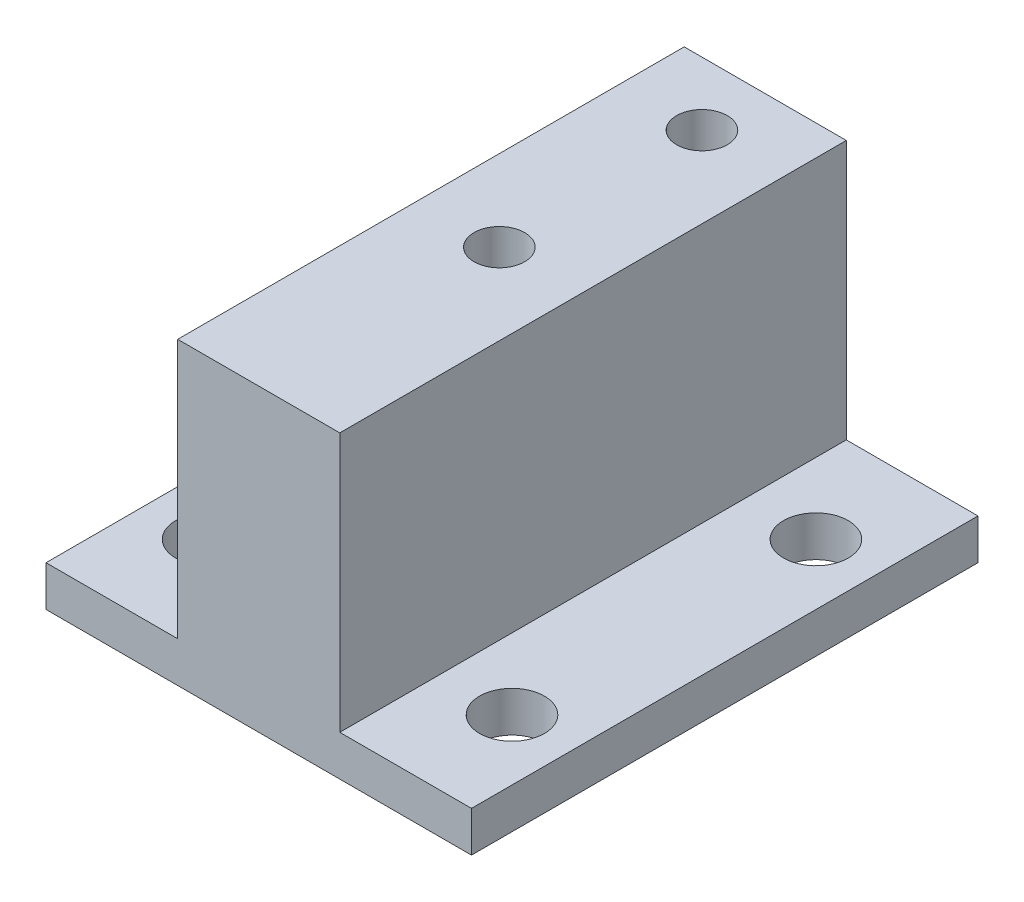
ISO-10303-21;
HEADER;
FILE_DESCRIPTION(('STEP AP214'),'2;1');
FILE_NAME('part.step','',(''),(''),'','','');
FILE_SCHEMA(('AUTOMOTIVE_DESIGN { 1 0 10303 214 1 1 1 1 }'));
ENDSEC;
DATA;
#1=APPLICATION_CONTEXT('core data for automotive mechanical design processes');
#2=APPLICATION_PROTOCOL_DEFINITION('international standard','automotive_design',2000,#1);
#3=PRODUCT_CONTEXT('',#1,'mechanical');
#4=PRODUCT('Part','Part','',(#3));
#5=PRODUCT_RELATED_PRODUCT_CATEGORY('part','',(#4));
#6=PRODUCT_DEFINITION_FORMATION('','',#4);
#7=PRODUCT_DEFINITION_CONTEXT('part definition',#1,'design');
#8=PRODUCT_DEFINITION('design','',#6,#7);
#9=PRODUCT_DEFINITION_SHAPE('','',#8);
#10=(LENGTH_UNIT() NAMED_UNIT(*) SI_UNIT(.MILLI.,.METRE.));
#11=(NAMED_UNIT(*) PLANE_ANGLE_UNIT() SI_UNIT($,.RADIAN.));
#12=(NAMED_UNIT(*) SI_UNIT($,.STERADIAN.) SOLID_ANGLE_UNIT());
#13=UNCERTAINTY_MEASURE_WITH_UNIT(LENGTH_MEASURE(1.E-05),#10,'distance_accuracy_value','');
#14=(GEOMETRIC_REPRESENTATION_CONTEXT(3) GLOBAL_UNCERTAINTY_ASSIGNED_CONTEXT((#13)) GLOBAL_UNIT_ASSIGNED_CONTEXT((#10,
#11,#12)) REPRESENTATION_CONTEXT('',''));
#15=CARTESIAN_POINT('',(0.,0.,0.));
#16=DIRECTION('',(0.,0.,1.));
#17=DIRECTION('',(1.,0.,0.));
#18=AXIS2_PLACEMENT_3D('',#15,#16,#17);
#19=CARTESIAN_POINT('',(20.,14.8,20.));
#20=DIRECTION('',(0.,1.,0.));
#21=DIRECTION('',(0.,0.,1.));
#22=AXIS2_PLACEMENT_3D('',#19,#20,#21);
#23=CYLINDRICAL_SURFACE('',#22,1.6);
#24=CARTESIAN_POINT('',(20.,0.,20.));
#25=DIRECTION('',(0.,1.,0.));
#26=DIRECTION('',(0.,0.,1.));
#27=AXIS2_PLACEMENT_3D('',#24,#25,#26);
#28=CIRCLE('',#27,1.6);
#29=CARTESIAN_POINT('',(20.,0.,21.6));
#30=VERTEX_POINT('',#29);
#31=EDGE_CURVE('E180',#30,#30,#28,.T.);
#32=ORIENTED_EDGE('',*,*,#31,.F.);
#33=EDGE_LOOP('',(#32));
#34=FACE_BOUND('',#33,.T.);
#35=CARTESIAN_POINT('',(20.,2.,20.));
#36=DIRECTION('',(0.,1.,0.));
#37=DIRECTION('',(0.,0.,1.));
#38=AXIS2_PLACEMENT_3D('',#35,#36,#37);
#39=CIRCLE('',#38,1.6);
#40=CARTESIAN_POINT('',(20.,2.,21.6));
#41=VERTEX_POINT('',#40);
#42=EDGE_CURVE('E405',#41,#41,#39,.F.);
#43=ORIENTED_EDGE('',*,*,#42,.F.);
#44=EDGE_LOOP('',(#43));
#45=FACE_BOUND('',#44,.T.);
#46=ADVANCED_FACE('F36',(#34,#45),#23,.F.);
#47=CARTESIAN_POINT('',(20.,14.8,5.));
#48=DIRECTION('',(0.,1.,0.));
#49=DIRECTION('',(0.,0.,1.));
#50=AXIS2_PLACEMENT_3D('',#47,#48,#49);
#51=CYLINDRICAL_SURFACE('',#50,1.6);
#52=CARTESIAN_POINT('',(20.,0.,5.));
#53=DIRECTION('',(0.,1.,0.));
#54=DIRECTION('',(0.,0.,1.));
#55=AXIS2_PLACEMENT_3D('',#52,#53,#54);
#56=CIRCLE('',#55,1.6);
#57=CARTESIAN_POINT('',(20.,0.,6.6));
#58=VERTEX_POINT('',#57);
#59=EDGE_CURVE('E177',#58,#58,#56,.T.);
#60=ORIENTED_EDGE('',*,*,#59,.F.);
#61=EDGE_LOOP('',(#60));
#62=FACE_BOUND('',#61,.T.);
#63=CARTESIAN_POINT('',(20.,2.,5.));
#64=DIRECTION('',(0.,1.,0.));
#65=DIRECTION('',(0.,0.,1.));
#66=AXIS2_PLACEMENT_3D('',#63,#64,#65);
#67=CIRCLE('',#66,1.6);
#68=CARTESIAN_POINT('',(20.,2.,6.6));
#69=VERTEX_POINT('',#68);
#70=EDGE_CURVE('E402',#69,#69,#67,.F.);
#71=ORIENTED_EDGE('',*,*,#70,.F.);
#72=EDGE_LOOP('',(#71));
#73=FACE_BOUND('',#72,.T.);
#74=ADVANCED_FACE('F214',(#62,#73),#51,.F.);
#75=CARTESIAN_POINT('',(23.,-4.74,25.));
#76=DIRECTION('',(-1.,0.,0.));
#77=DIRECTION('',(0.,0.,1.));
#78=AXIS2_PLACEMENT_3D('',#75,#76,#77);
#79=PLANE('',#78);
#80=DIRECTION('',(0.,0.,-1.));
#81=VECTOR('',#80,1.);
#82=CARTESIAN_POINT('',(23.,2.,25.));
#83=LINE('',#82,#81);
#84=CARTESIAN_POINT('',(23.,2.,25.));
#85=VERTEX_POINT('',#84);
#86=CARTESIAN_POINT('',(23.,2.,0.));
#87=VERTEX_POINT('',#86);
#88=EDGE_CURVE('E108',#85,#87,#83,.T.);
#89=ORIENTED_EDGE('',*,*,#88,.F.);
#90=DIRECTION('',(0.,1.,0.));
#91=VECTOR('',#90,1.);
#92=CARTESIAN_POINT('',(23.,-4.74,25.));
#93=LINE('',#92,#91);
#94=CARTESIAN_POINT('',(23.,0.,25.));
#95=VERTEX_POINT('',#94);
#96=EDGE_CURVE('E130',#95,#85,#93,.T.);
#97=ORIENTED_EDGE('',*,*,#96,.F.);
#98=DIRECTION('',(0.,0.,1.));
#99=VECTOR('',#98,1.);
#100=CARTESIAN_POINT('',(23.,0.,0.));
#101=LINE('',#100,#99);
#102=CARTESIAN_POINT('',(23.,0.,0.));
#103=VERTEX_POINT('',#102);
#104=EDGE_CURVE('E129',#103,#95,#101,.T.);
#105=ORIENTED_EDGE('',*,*,#104,.F.);
#106=DIRECTION('',(0.,1.,0.));
#107=VECTOR('',#106,1.);
#108=CARTESIAN_POINT('',(23.,-4.74,0.));
#109=LINE('',#108,#107);
#110=EDGE_CURVE('E120',#103,#87,#109,.T.);
#111=ORIENTED_EDGE('',*,*,#110,.T.);
#112=EDGE_LOOP('',(#89,#97,#105,#111));
#113=FACE_BOUND('',#112,.T.);
#114=ADVANCED_FACE('F127',(#113),#79,.F.);
#115=CARTESIAN_POINT('',(5.,14.8,20.));
#116=DIRECTION('',(0.,1.,0.));
#117=DIRECTION('',(0.,0.,1.));
#118=AXIS2_PLACEMENT_3D('',#115,#116,#117);
#119=CYLINDRICAL_SURFACE('',#118,1.6);
#120=CARTESIAN_POINT('',(5.,0.,20.));
#121=DIRECTION('',(0.,1.,0.));
#122=DIRECTION('',(0.,0.,1.));
#123=AXIS2_PLACEMENT_3D('',#120,#121,#122);
#124=CIRCLE('',#123,1.6);
#125=CARTESIAN_POINT('',(5.,0.,21.6));
#126=VERTEX_POINT('',#125);
#127=EDGE_CURVE('E183',#126,#126,#124,.T.);
#128=ORIENTED_EDGE('',*,*,#127,.F.);
#129=EDGE_LOOP('',(#128));
#130=FACE_BOUND('',#129,.T.);
#131=CARTESIAN_POINT('',(5.,2.,20.));
#132=DIRECTION('',(0.,1.,0.));
#133=DIRECTION('',(0.,0.,1.));
#134=AXIS2_PLACEMENT_3D('',#131,#132,#133);
#135=CIRCLE('',#134,1.6);
#136=CARTESIAN_POINT('',(5.,2.,21.6));
#137=VERTEX_POINT('',#136);
#138=EDGE_CURVE('E131',#137,#137,#135,.F.);
#139=ORIENTED_EDGE('',*,*,#138,.F.);
#140=EDGE_LOOP('',(#139));
#141=FACE_BOUND('',#140,.T.);
#142=ADVANCED_FACE('F226',(#130,#141),#119,.F.);
#143=CARTESIAN_POINT('',(4.99999999999995,14.8,5.));
#144=DIRECTION('',(0.,1.,0.));
#145=DIRECTION('',(0.,0.,1.));
#146=AXIS2_PLACEMENT_3D('',#143,#144,#145);
#147=CYLINDRICAL_SURFACE('',#146,1.6);
#148=CARTESIAN_POINT('',(4.99999999999995,0.,5.));
#149=DIRECTION('',(0.,1.,0.));
#150=DIRECTION('',(0.,0.,1.));
#151=AXIS2_PLACEMENT_3D('',#148,#149,#150);
#152=CIRCLE('',#151,1.6);
#153=CARTESIAN_POINT('',(4.99999999999995,0.,6.6));
#154=VERTEX_POINT('',#153);
#155=EDGE_CURVE('E174',#154,#154,#152,.T.);
#156=ORIENTED_EDGE('',*,*,#155,.F.);
#157=EDGE_LOOP('',(#156));
#158=FACE_BOUND('',#157,.T.);
#159=CARTESIAN_POINT('',(4.99999999999995,2.,5.));
#160=DIRECTION('',(0.,1.,0.));
#161=DIRECTION('',(0.,0.,1.));
#162=AXIS2_PLACEMENT_3D('',#159,#160,#161);
#163=CIRCLE('',#162,1.6);
#164=CARTESIAN_POINT('',(4.99999999999995,2.,6.6));
#165=VERTEX_POINT('',#164);
#166=EDGE_CURVE('E135',#165,#165,#163,.F.);
#167=ORIENTED_EDGE('',*,*,#166,.F.);
#168=EDGE_LOOP('',(#167));
#169=FACE_BOUND('',#168,.T.);
#170=ADVANCED_FACE('F228',(#158,#169),#147,.F.);
#171=CARTESIAN_POINT('',(2.,-4.74,25.));
#172=DIRECTION('',(1.,0.,0.));
#173=DIRECTION('',(0.,0.,-1.));
#174=AXIS2_PLACEMENT_3D('',#171,#172,#173);
#175=PLANE('',#174);
#176=DIRECTION('',(0.,0.,1.));
#177=VECTOR('',#176,1.);
#178=CARTESIAN_POINT('',(2.,2.,25.));
#179=LINE('',#178,#177);
#180=CARTESIAN_POINT('',(2.,2.,0.));
#181=VERTEX_POINT('',#180);
#182=CARTESIAN_POINT('',(2.,2.,25.));
#183=VERTEX_POINT('',#182);
#184=EDGE_CURVE('E196',#181,#183,#179,.T.);
#185=ORIENTED_EDGE('',*,*,#184,.F.);
#186=DIRECTION('',(0.,1.,0.));
#187=VECTOR('',#186,1.);
#188=CARTESIAN_POINT('',(2.,-4.74,0.));
#189=LINE('',#188,#187);
#190=CARTESIAN_POINT('',(2.,0.,0.));
#191=VERTEX_POINT('',#190);
#192=EDGE_CURVE('E140',#191,#181,#189,.T.);
#193=ORIENTED_EDGE('',*,*,#192,.F.);
#194=DIRECTION('',(0.,0.,-1.));
#195=VECTOR('',#194,1.);
#196=CARTESIAN_POINT('',(2.,0.,0.));
#197=LINE('',#196,#195);
#198=CARTESIAN_POINT('',(2.,0.,25.));
#199=VERTEX_POINT('',#198);
#200=EDGE_CURVE('E143',#199,#191,#197,.T.);
#201=ORIENTED_EDGE('',*,*,#200,.F.);
#202=DIRECTION('',(0.,1.,0.));
#203=VECTOR('',#202,1.);
#204=CARTESIAN_POINT('',(2.,-4.74,25.));
#205=LINE('',#204,#203);
#206=EDGE_CURVE('E139',#199,#183,#205,.T.);
#207=ORIENTED_EDGE('',*,*,#206,.T.);
#208=EDGE_LOOP('',(#185,#193,#201,#207));
#209=FACE_BOUND('',#208,.T.);
#210=ADVANCED_FACE('F195',(#209),#175,.F.);
#211=CARTESIAN_POINT('',(0.,14.8,25.));
#212=DIRECTION('',(0.,0.,-1.));
#213=DIRECTION('',(-1.,0.,0.));
#214=AXIS2_PLACEMENT_3D('',#211,#212,#213);
#215=PLANE('',#214);
#216=DIRECTION('',(1.,0.,0.));
#217=VECTOR('',#216,1.);
#218=CARTESIAN_POINT('',(23.,2.,25.));
#219=LINE('',#218,#217);
#220=CARTESIAN_POINT('',(16.5,2.,25.));
#221=VERTEX_POINT('',#220);
#222=EDGE_CURVE('E53',#221,#85,#219,.T.);
#223=ORIENTED_EDGE('',*,*,#222,.F.);
#224=DIRECTION('',(0.,1.,0.));
#225=VECTOR('',#224,1.);
#226=CARTESIAN_POINT('',(16.5,5.03,25.));
#227=LINE('',#226,#225);
#228=CARTESIAN_POINT('',(16.5,14.8,25.));
#229=VERTEX_POINT('',#228);
#230=EDGE_CURVE('E150',#221,#229,#227,.T.);
#231=ORIENTED_EDGE('',*,*,#230,.T.);
#232=DIRECTION('',(1.,0.,0.));
#233=VECTOR('',#232,1.);
#234=CARTESIAN_POINT('',(0.,14.8,25.));
#235=LINE('',#234,#233);
#236=CARTESIAN_POINT('',(8.5,14.8,25.));
#237=VERTEX_POINT('',#236);
#238=EDGE_CURVE('E45',#237,#229,#235,.T.);
#239=ORIENTED_EDGE('',*,*,#238,.F.);
#240=DIRECTION('',(0.,1.,0.));
#241=VECTOR('',#240,1.);
#242=CARTESIAN_POINT('',(8.5,5.03,25.));
#243=LINE('',#242,#241);
#244=CARTESIAN_POINT('',(8.5,2.,25.));
#245=VERTEX_POINT('',#244);
#246=EDGE_CURVE('E157',#245,#237,#243,.T.);
#247=ORIENTED_EDGE('',*,*,#246,.F.);
#248=DIRECTION('',(1.,0.,0.));
#249=VECTOR('',#248,1.);
#250=CARTESIAN_POINT('',(8.5,2.,25.));
#251=LINE('',#250,#249);
#252=EDGE_CURVE('E415',#183,#245,#251,.T.);
#253=ORIENTED_EDGE('',*,*,#252,.F.);
#254=ORIENTED_EDGE('',*,*,#206,.F.);
#255=DIRECTION('',(1.,0.,0.));
#256=VECTOR('',#255,1.);
#257=CARTESIAN_POINT('',(0.,0.,25.));
#258=LINE('',#257,#256);
#259=EDGE_CURVE('E186',#199,#95,#258,.T.);
#260=ORIENTED_EDGE('',*,*,#259,.T.);
#261=ORIENTED_EDGE('',*,*,#96,.T.);
#262=EDGE_LOOP('',(#223,#231,#239,#247,#253,#254,#260,#261));
#263=FACE_BOUND('',#262,.T.);
#264=ADVANCED_FACE('F38',(#263),#215,.F.);
#265=CARTESIAN_POINT('',(0.,14.8,0.));
#266=DIRECTION('',(0.,0.,1.));
#267=DIRECTION('',(1.,0.,0.));
#268=AXIS2_PLACEMENT_3D('',#265,#266,#267);
#269=PLANE('',#268);
#270=DIRECTION('',(0.,1.,0.));
#271=VECTOR('',#270,1.);
#272=CARTESIAN_POINT('',(16.5,5.03,0.));
#273=LINE('',#272,#271);
#274=CARTESIAN_POINT('',(16.5,2.,0.));
#275=VERTEX_POINT('',#274);
#276=CARTESIAN_POINT('',(16.5,14.8,0.));
#277=VERTEX_POINT('',#276);
#278=EDGE_CURVE('E123',#275,#277,#273,.T.);
#279=ORIENTED_EDGE('',*,*,#278,.F.);
#280=DIRECTION('',(-1.,0.,0.));
#281=VECTOR('',#280,1.);
#282=CARTESIAN_POINT('',(23.,2.,0.));
#283=LINE('',#282,#281);
#284=EDGE_CURVE('E112',#87,#275,#283,.T.);
#285=ORIENTED_EDGE('',*,*,#284,.F.);
#286=ORIENTED_EDGE('',*,*,#110,.F.);
#287=DIRECTION('',(-1.,0.,0.));
#288=VECTOR('',#287,1.);
#289=CARTESIAN_POINT('',(0.,0.,0.));
#290=LINE('',#289,#288);
#291=EDGE_CURVE('E40',#103,#191,#290,.T.);
#292=ORIENTED_EDGE('',*,*,#291,.T.);
#293=ORIENTED_EDGE('',*,*,#192,.T.);
#294=DIRECTION('',(-1.,0.,0.));
#295=VECTOR('',#294,1.);
#296=CARTESIAN_POINT('',(8.5,2.,0.));
#297=LINE('',#296,#295);
#298=CARTESIAN_POINT('',(8.5,2.,0.));
#299=VERTEX_POINT('',#298);
#300=EDGE_CURVE('E61',#299,#181,#297,.T.);
#301=ORIENTED_EDGE('',*,*,#300,.F.);
#302=DIRECTION('',(0.,1.,0.));
#303=VECTOR('',#302,1.);
#304=CARTESIAN_POINT('',(8.5,5.03,0.));
#305=LINE('',#304,#303);
#306=CARTESIAN_POINT('',(8.5,14.8,0.));
#307=VERTEX_POINT('',#306);
#308=EDGE_CURVE('E158',#299,#307,#305,.T.);
#309=ORIENTED_EDGE('',*,*,#308,.T.);
#310=DIRECTION('',(-1.,0.,0.));
#311=VECTOR('',#310,1.);
#312=CARTESIAN_POINT('',(0.,14.8,0.));
#313=LINE('',#312,#311);
#314=EDGE_CURVE('E11',#277,#307,#313,.T.);
#315=ORIENTED_EDGE('',*,*,#314,.F.);
#316=EDGE_LOOP('',(#279,#285,#286,#292,#293,#301,#309,#315));
#317=FACE_BOUND('',#316,.T.);
#318=ADVANCED_FACE('F119',(#317),#269,.F.);
#319=CARTESIAN_POINT('',(0.,14.8,0.));
#320=DIRECTION('',(0.,1.,0.));
#321=DIRECTION('',(0.,0.,1.));
#322=AXIS2_PLACEMENT_3D('',#319,#320,#321);
#323=PLANE('',#322);
#324=DIRECTION('',(0.,0.,1.));
#325=VECTOR('',#324,1.);
#326=CARTESIAN_POINT('',(16.5,14.8,25.));
#327=LINE('',#326,#325);
#328=EDGE_CURVE('E148',#277,#229,#327,.T.);
#329=ORIENTED_EDGE('',*,*,#328,.F.);
#330=ORIENTED_EDGE('',*,*,#314,.T.);
#331=DIRECTION('',(0.,0.,-1.));
#332=VECTOR('',#331,1.);
#333=CARTESIAN_POINT('',(8.5,14.8,25.));
#334=LINE('',#333,#332);
#335=EDGE_CURVE('E153',#237,#307,#334,.T.);
#336=ORIENTED_EDGE('',*,*,#335,.F.);
#337=ORIENTED_EDGE('',*,*,#238,.T.);
#338=EDGE_LOOP('',(#329,#330,#336,#337));
#339=FACE_BOUND('',#338,.T.);
#340=CARTESIAN_POINT('',(12.5,14.8,3.12423319118437));
#341=DIRECTION('',(0.,1.,0.));
#342=DIRECTION('',(0.,0.,1.));
#343=AXIS2_PLACEMENT_3D('',#340,#341,#342);
#344=CIRCLE('',#343,1.25);
#345=CARTESIAN_POINT('',(12.5,14.8,4.37423319118436));
#346=VERTEX_POINT('',#345);
#347=EDGE_CURVE('E161',#346,#346,#344,.T.);
#348=ORIENTED_EDGE('',*,*,#347,.F.);
#349=EDGE_LOOP('',(#348));
#350=FACE_BOUND('',#349,.T.);
#351=CARTESIAN_POINT('',(12.5000000000001,14.8,13.1242331911844));
#352=DIRECTION('',(0.,1.,0.));
#353=DIRECTION('',(0.,0.,1.));
#354=AXIS2_PLACEMENT_3D('',#351,#352,#353);
#355=CIRCLE('',#354,1.25);
#356=CARTESIAN_POINT('',(12.5000000000001,14.8,14.3742331911844));
#357=VERTEX_POINT('',#356);
#358=EDGE_CURVE('E168',#357,#357,#355,.T.);
#359=ORIENTED_EDGE('',*,*,#358,.F.);
#360=EDGE_LOOP('',(#359));
#361=FACE_BOUND('',#360,.T.);
#362=ADVANCED_FACE('F200',(#339,#350,#361),#323,.T.);
#363=CARTESIAN_POINT('',(0.,0.,0.));
#364=DIRECTION('',(0.,1.,0.));
#365=DIRECTION('',(0.,0.,1.));
#366=AXIS2_PLACEMENT_3D('',#363,#364,#365);
#367=PLANE('',#366);
#368=ORIENTED_EDGE('',*,*,#155,.T.);
#369=EDGE_LOOP('',(#368));
#370=FACE_BOUND('',#369,.T.);
#371=ORIENTED_EDGE('',*,*,#59,.T.);
#372=EDGE_LOOP('',(#371));
#373=FACE_BOUND('',#372,.T.);
#374=ORIENTED_EDGE('',*,*,#31,.T.);
#375=EDGE_LOOP('',(#374));
#376=FACE_BOUND('',#375,.T.);
#377=ORIENTED_EDGE('',*,*,#127,.T.);
#378=EDGE_LOOP('',(#377));
#379=FACE_BOUND('',#378,.T.);
#380=ORIENTED_EDGE('',*,*,#291,.F.);
#381=ORIENTED_EDGE('',*,*,#104,.T.);
#382=ORIENTED_EDGE('',*,*,#259,.F.);
#383=ORIENTED_EDGE('',*,*,#200,.T.);
#384=EDGE_LOOP('',(#380,#381,#382,#383));
#385=FACE_BOUND('',#384,.T.);
#386=ADVANCED_FACE('F197',(#370,#373,#376,#379,#385),#367,.F.);
#387=CARTESIAN_POINT('',(12.5000000000001,7.3,13.1242331911844));
#388=DIRECTION('',(0.,1.,0.));
#389=DIRECTION('',(0.,0.,1.));
#390=AXIS2_PLACEMENT_3D('',#387,#388,#389);
#391=CONICAL_SURFACE('',#390,1.25,1.02974425867665);
#392=CARTESIAN_POINT('',(12.5000000000001,6.54892422621555,13.1242331911844));
#393=VERTEX_POINT('',#392);
#394=VERTEX_LOOP('',#393);
#395=FACE_BOUND('',#394,.T.);
#396=CARTESIAN_POINT('',(12.5000000000001,7.3,13.1242331911844));
#397=DIRECTION('',(0.,1.,0.));
#398=DIRECTION('',(0.,0.,1.));
#399=AXIS2_PLACEMENT_3D('',#396,#397,#398);
#400=CIRCLE('',#399,1.25);
#401=CARTESIAN_POINT('',(12.5000000000001,7.3,14.3742331911844));
#402=VERTEX_POINT('',#401);
#403=EDGE_CURVE('E171',#402,#402,#400,.T.);
#404=ORIENTED_EDGE('',*,*,#403,.T.);
#405=EDGE_LOOP('',(#404));
#406=FACE_BOUND('',#405,.T.);
#407=ADVANCED_FACE('F199',(#395,#406),#391,.F.);
#408=CARTESIAN_POINT('',(12.5000000000001,14.8,13.1242331911844));
#409=DIRECTION('',(0.,1.,0.));
#410=DIRECTION('',(0.,0.,1.));
#411=AXIS2_PLACEMENT_3D('',#408,#409,#410);
#412=CYLINDRICAL_SURFACE('',#411,1.25);
#413=ORIENTED_EDGE('',*,*,#403,.F.);
#414=EDGE_LOOP('',(#413));
#415=FACE_BOUND('',#414,.T.);
#416=ORIENTED_EDGE('',*,*,#358,.T.);
#417=EDGE_LOOP('',(#416));
#418=FACE_BOUND('',#417,.T.);
#419=ADVANCED_FACE('F207',(#415,#418),#412,.F.);
#420=CARTESIAN_POINT('',(12.5,7.3,3.12423319118437));
#421=DIRECTION('',(0.,1.,0.));
#422=DIRECTION('',(0.,0.,1.));
#423=AXIS2_PLACEMENT_3D('',#420,#421,#422);
#424=CONICAL_SURFACE('',#423,1.25,1.02974425867665);
#425=CARTESIAN_POINT('',(12.5,6.54892422621555,3.12423319118437));
#426=VERTEX_POINT('',#425);
#427=VERTEX_LOOP('',#426);
#428=FACE_BOUND('',#427,.T.);
#429=CARTESIAN_POINT('',(12.5,7.3,3.12423319118437));
#430=DIRECTION('',(0.,1.,0.));
#431=DIRECTION('',(0.,0.,1.));
#432=AXIS2_PLACEMENT_3D('',#429,#430,#431);
#433=CIRCLE('',#432,1.25);
#434=CARTESIAN_POINT('',(12.5,7.3,4.37423319118436));
#435=VERTEX_POINT('',#434);
#436=EDGE_CURVE('E165',#435,#435,#433,.T.);
#437=ORIENTED_EDGE('',*,*,#436,.T.);
#438=EDGE_LOOP('',(#437));
#439=FACE_BOUND('',#438,.T.);
#440=ADVANCED_FACE('F262',(#428,#439),#424,.F.);
#441=CARTESIAN_POINT('',(12.5,14.8,3.12423319118437));
#442=DIRECTION('',(0.,1.,0.));
#443=DIRECTION('',(0.,0.,1.));
#444=AXIS2_PLACEMENT_3D('',#441,#442,#443);
#445=CYLINDRICAL_SURFACE('',#444,1.25);
#446=ORIENTED_EDGE('',*,*,#436,.F.);
#447=EDGE_LOOP('',(#446));
#448=FACE_BOUND('',#447,.T.);
#449=ORIENTED_EDGE('',*,*,#347,.T.);
#450=EDGE_LOOP('',(#449));
#451=FACE_BOUND('',#450,.T.);
#452=ADVANCED_FACE('F258',(#448,#451),#445,.F.);
#453=CARTESIAN_POINT('',(8.5,5.03,25.));
#454=DIRECTION('',(1.,0.,0.));
#455=DIRECTION('',(0.,0.,-1.));
#456=AXIS2_PLACEMENT_3D('',#453,#454,#455);
#457=PLANE('',#456);
#458=ORIENTED_EDGE('',*,*,#335,.T.);
#459=ORIENTED_EDGE('',*,*,#308,.F.);
#460=DIRECTION('',(0.,0.,-1.));
#461=VECTOR('',#460,1.);
#462=CARTESIAN_POINT('',(8.5,2.,25.));
#463=LINE('',#462,#461);
#464=EDGE_CURVE('E411',#245,#299,#463,.T.);
#465=ORIENTED_EDGE('',*,*,#464,.F.);
#466=ORIENTED_EDGE('',*,*,#246,.T.);
#467=EDGE_LOOP('',(#458,#459,#465,#466));
#468=FACE_BOUND('',#467,.T.);
#469=ADVANCED_FACE('F249',(#468),#457,.F.);
#470=CARTESIAN_POINT('',(16.5,5.03,25.));
#471=DIRECTION('',(-1.,0.,0.));
#472=DIRECTION('',(0.,0.,1.));
#473=AXIS2_PLACEMENT_3D('',#470,#471,#472);
#474=PLANE('',#473);
#475=ORIENTED_EDGE('',*,*,#328,.T.);
#476=ORIENTED_EDGE('',*,*,#230,.F.);
#477=DIRECTION('',(0.,0.,1.));
#478=VECTOR('',#477,1.);
#479=CARTESIAN_POINT('',(16.5,2.,25.));
#480=LINE('',#479,#478);
#481=EDGE_CURVE('E125',#275,#221,#480,.T.);
#482=ORIENTED_EDGE('',*,*,#481,.F.);
#483=ORIENTED_EDGE('',*,*,#278,.T.);
#484=EDGE_LOOP('',(#475,#476,#482,#483));
#485=FACE_BOUND('',#484,.T.);
#486=ADVANCED_FACE('F242',(#485),#474,.F.);
#487=CARTESIAN_POINT('',(0.,2.,0.));
#488=DIRECTION('',(0.,1.,0.));
#489=DIRECTION('',(0.,0.,1.));
#490=AXIS2_PLACEMENT_3D('',#487,#488,#489);
#491=PLANE('',#490);
#492=ORIENTED_EDGE('',*,*,#464,.T.);
#493=ORIENTED_EDGE('',*,*,#300,.T.);
#494=ORIENTED_EDGE('',*,*,#184,.T.);
#495=ORIENTED_EDGE('',*,*,#252,.T.);
#496=EDGE_LOOP('',(#492,#493,#494,#495));
#497=FACE_BOUND('',#496,.T.);
#498=ORIENTED_EDGE('',*,*,#166,.T.);
#499=EDGE_LOOP('',(#498));
#500=FACE_BOUND('',#499,.T.);
#501=ORIENTED_EDGE('',*,*,#138,.T.);
#502=EDGE_LOOP('',(#501));
#503=FACE_BOUND('',#502,.T.);
#504=ADVANCED_FACE('F240',(#497,#500,#503),#491,.T.);
#505=CARTESIAN_POINT('',(0.,2.,0.));
#506=DIRECTION('',(0.,1.,0.));
#507=DIRECTION('',(0.,0.,1.));
#508=AXIS2_PLACEMENT_3D('',#505,#506,#507);
#509=PLANE('',#508);
#510=ORIENTED_EDGE('',*,*,#88,.T.);
#511=ORIENTED_EDGE('',*,*,#284,.T.);
#512=ORIENTED_EDGE('',*,*,#481,.T.);
#513=ORIENTED_EDGE('',*,*,#222,.T.);
#514=EDGE_LOOP('',(#510,#511,#512,#513));
#515=FACE_BOUND('',#514,.T.);
#516=ORIENTED_EDGE('',*,*,#70,.T.);
#517=EDGE_LOOP('',(#516));
#518=FACE_BOUND('',#517,.T.);
#519=ORIENTED_EDGE('',*,*,#42,.T.);
#520=EDGE_LOOP('',(#519));
#521=FACE_BOUND('',#520,.T.);
#522=ADVANCED_FACE('F110',(#515,#518,#521),#509,.T.);
#523=CLOSED_SHELL('',(#46,#74,#114,#142,#170,#210,#264,#318,#362,#386,#407,#419,#440,#452,#469,
#486,#504,#522));
#524=MANIFOLD_SOLID_BREP('B2',#523);
#525=ADVANCED_BREP_SHAPE_REPRESENTATION('',(#18,#524),#14);
#526=SHAPE_DEFINITION_REPRESENTATION(#9,#525);
ENDSEC;
END-ISO-10303-21;
